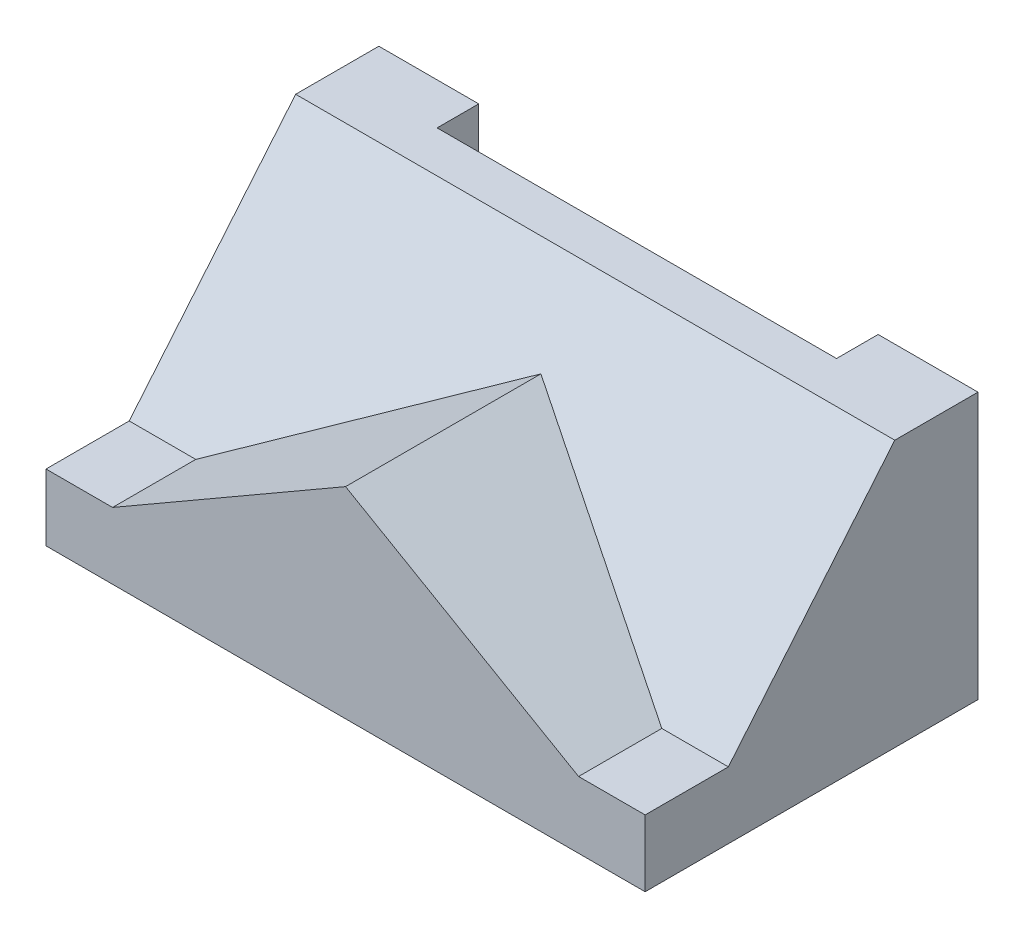
ISO-10303-21;
HEADER;
FILE_DESCRIPTION(('STEP AP214'),'2;1');
FILE_NAME('part.step','',(''),(''),'','','');
FILE_SCHEMA(('AUTOMOTIVE_DESIGN { 1 0 10303 214 1 1 1 1 }'));
ENDSEC;
DATA;
#1=APPLICATION_CONTEXT('core data for automotive mechanical design processes');
#2=APPLICATION_PROTOCOL_DEFINITION('international standard','automotive_design',2000,#1);
#3=PRODUCT_CONTEXT('',#1,'mechanical');
#4=PRODUCT('Part','Part','',(#3));
#5=PRODUCT_RELATED_PRODUCT_CATEGORY('part','',(#4));
#6=PRODUCT_DEFINITION_FORMATION('','',#4);
#7=PRODUCT_DEFINITION_CONTEXT('part definition',#1,'design');
#8=PRODUCT_DEFINITION('design','',#6,#7);
#9=PRODUCT_DEFINITION_SHAPE('','',#8);
#10=(LENGTH_UNIT() NAMED_UNIT(*) SI_UNIT(.MILLI.,.METRE.));
#11=(NAMED_UNIT(*) PLANE_ANGLE_UNIT() SI_UNIT($,.RADIAN.));
#12=(NAMED_UNIT(*) SI_UNIT($,.STERADIAN.) SOLID_ANGLE_UNIT());
#13=UNCERTAINTY_MEASURE_WITH_UNIT(LENGTH_MEASURE(1.E-05),#10,'distance_accuracy_value','');
#14=(GEOMETRIC_REPRESENTATION_CONTEXT(3) GLOBAL_UNCERTAINTY_ASSIGNED_CONTEXT((#13)) GLOBAL_UNIT_ASSIGNED_CONTEXT((#10,
#11,#12)) REPRESENTATION_CONTEXT('',''));
#15=CARTESIAN_POINT('',(0.,0.,0.));
#16=DIRECTION('',(0.,0.,1.));
#17=DIRECTION('',(1.,0.,0.));
#18=AXIS2_PLACEMENT_3D('',#15,#16,#17);
#19=CARTESIAN_POINT('',(57.15,0.,0.));
#20=DIRECTION('',(0.,0.,1.));
#21=DIRECTION('',(1.,0.,0.));
#22=AXIS2_PLACEMENT_3D('',#19,#20,#21);
#23=PLANE('',#22);
#24=DIRECTION('',(-1.,0.,0.));
#25=VECTOR('',#24,1.);
#26=CARTESIAN_POINT('',(57.15,50.8,0.));
#27=LINE('',#26,#25);
#28=CARTESIAN_POINT('',(-38.1,50.8,0.));
#29=VERTEX_POINT('',#28);
#30=CARTESIAN_POINT('',(-57.15,50.8,0.));
#31=VERTEX_POINT('',#30);
#32=EDGE_CURVE('E217',#29,#31,#27,.T.);
#33=ORIENTED_EDGE('',*,*,#32,.F.);
#34=DIRECTION('',(0.,1.,0.));
#35=VECTOR('',#34,1.);
#36=CARTESIAN_POINT('',(-38.1,-0.001000000000001,0.));
#37=LINE('',#36,#35);
#38=CARTESIAN_POINT('',(-38.1,0.,0.));
#39=VERTEX_POINT('',#38);
#40=EDGE_CURVE('E145',#39,#29,#37,.T.);
#41=ORIENTED_EDGE('',*,*,#40,.F.);
#42=DIRECTION('',(-1.,0.,0.));
#43=VECTOR('',#42,1.);
#44=CARTESIAN_POINT('',(57.15,0.,0.));
#45=LINE('',#44,#43);
#46=CARTESIAN_POINT('',(-57.15,0.,0.));
#47=VERTEX_POINT('',#46);
#48=EDGE_CURVE('E150',#39,#47,#45,.T.);
#49=ORIENTED_EDGE('',*,*,#48,.T.);
#50=DIRECTION('',(0.,1.,0.));
#51=VECTOR('',#50,1.);
#52=CARTESIAN_POINT('',(-57.15,0.,0.));
#53=LINE('',#52,#51);
#54=EDGE_CURVE('E197',#47,#31,#53,.T.);
#55=ORIENTED_EDGE('',*,*,#54,.T.);
#56=EDGE_LOOP('',(#33,#41,#49,#55));
#57=FACE_BOUND('',#56,.T.);
#58=ADVANCED_FACE('F33',(#57),#23,.F.);
#59=CARTESIAN_POINT('',(57.15,12.7,47.625));
#60=DIRECTION('',(0.,-1.,0.));
#61=DIRECTION('',(0.,0.,-1.));
#62=AXIS2_PLACEMENT_3D('',#59,#60,#61);
#63=PLANE('',#62);
#64=DIRECTION('',(-1.,0.,0.));
#65=VECTOR('',#64,1.);
#66=CARTESIAN_POINT('',(57.15,12.7,47.625));
#67=LINE('',#66,#65);
#68=CARTESIAN_POINT('',(57.15,12.7,47.625));
#69=VERTEX_POINT('',#68);
#70=CARTESIAN_POINT('',(44.45,12.7,47.6249999999823));
#71=VERTEX_POINT('',#70);
#72=EDGE_CURVE('E211',#69,#71,#67,.T.);
#73=ORIENTED_EDGE('',*,*,#72,.T.);
#74=DIRECTION('',(0.,0.,1.));
#75=VECTOR('',#74,1.);
#76=CARTESIAN_POINT('',(44.45,12.7,-500000.));
#77=LINE('',#76,#75);
#78=CARTESIAN_POINT('',(44.45,12.7,63.5));
#79=VERTEX_POINT('',#78);
#80=EDGE_CURVE('E174',#71,#79,#77,.T.);
#81=ORIENTED_EDGE('',*,*,#80,.T.);
#82=DIRECTION('',(-1.,0.,0.));
#83=VECTOR('',#82,1.);
#84=CARTESIAN_POINT('',(57.15,12.7,63.5));
#85=LINE('',#84,#83);
#86=CARTESIAN_POINT('',(57.15,12.7,63.5));
#87=VERTEX_POINT('',#86);
#88=EDGE_CURVE('E207',#87,#79,#85,.T.);
#89=ORIENTED_EDGE('',*,*,#88,.F.);
#90=DIRECTION('',(0.,0.,1.));
#91=VECTOR('',#90,1.);
#92=CARTESIAN_POINT('',(57.15,12.7,47.625));
#93=LINE('',#92,#91);
#94=EDGE_CURVE('E190',#69,#87,#93,.T.);
#95=ORIENTED_EDGE('',*,*,#94,.F.);
#96=EDGE_LOOP('',(#73,#81,#89,#95));
#97=FACE_BOUND('',#96,.T.);
#98=ADVANCED_FACE('F265',(#97),#63,.F.);
#99=CARTESIAN_POINT('',(57.15,12.7,63.5));
#100=DIRECTION('',(0.,0.,-1.));
#101=DIRECTION('',(-1.,0.,0.));
#102=AXIS2_PLACEMENT_3D('',#99,#100,#101);
#103=PLANE('',#102);
#104=DIRECTION('',(0.,-1.,0.));
#105=VECTOR('',#104,1.);
#106=CARTESIAN_POINT('',(-57.15,12.7,63.5));
#107=LINE('',#106,#105);
#108=CARTESIAN_POINT('',(-57.15,12.7,63.5));
#109=VERTEX_POINT('',#108);
#110=CARTESIAN_POINT('',(-57.15,0.,63.5));
#111=VERTEX_POINT('',#110);
#112=EDGE_CURVE('E169',#109,#111,#107,.T.);
#113=ORIENTED_EDGE('',*,*,#112,.T.);
#114=DIRECTION('',(-1.,0.,0.));
#115=VECTOR('',#114,1.);
#116=CARTESIAN_POINT('',(57.15,0.,63.5));
#117=LINE('',#116,#115);
#118=CARTESIAN_POINT('',(57.15,0.,63.5));
#119=VERTEX_POINT('',#118);
#120=EDGE_CURVE('E11',#119,#111,#117,.T.);
#121=ORIENTED_EDGE('',*,*,#120,.F.);
#122=DIRECTION('',(0.,-1.,0.));
#123=VECTOR('',#122,1.);
#124=CARTESIAN_POINT('',(57.15,12.7,63.5));
#125=LINE('',#124,#123);
#126=EDGE_CURVE('E178',#87,#119,#125,.T.);
#127=ORIENTED_EDGE('',*,*,#126,.F.);
#128=ORIENTED_EDGE('',*,*,#88,.T.);
#129=DIRECTION('',(-0.86602540378444,0.499999999999998,0.));
#130=VECTOR('',#129,1.);
#131=CARTESIAN_POINT('',(44.45,12.7,63.5));
#132=LINE('',#131,#130);
#133=CARTESIAN_POINT('',(0.,38.3632194654787,63.5));
#134=VERTEX_POINT('',#133);
#135=EDGE_CURVE('E170',#79,#134,#132,.T.);
#136=ORIENTED_EDGE('',*,*,#135,.T.);
#137=DIRECTION('',(-0.86602540378444,-0.499999999999998,0.));
#138=VECTOR('',#137,1.);
#139=CARTESIAN_POINT('',(-44.45,12.7,63.5));
#140=LINE('',#139,#138);
#141=CARTESIAN_POINT('',(-44.45,12.7,63.5));
#142=VERTEX_POINT('',#141);
#143=EDGE_CURVE('E56',#134,#142,#140,.T.);
#144=ORIENTED_EDGE('',*,*,#143,.T.);
#145=EDGE_CURVE('E192',#142,#109,#85,.T.);
#146=ORIENTED_EDGE('',*,*,#145,.T.);
#147=EDGE_LOOP('',(#113,#121,#127,#128,#136,#144,#146));
#148=FACE_BOUND('',#147,.T.);
#149=ADVANCED_FACE('F35',(#148),#103,.F.);
#150=CARTESIAN_POINT('',(57.15,0.,63.5));
#151=DIRECTION('',(0.,1.,0.));
#152=DIRECTION('',(0.,0.,1.));
#153=AXIS2_PLACEMENT_3D('',#150,#151,#152);
#154=PLANE('',#153);
#155=ORIENTED_EDGE('',*,*,#48,.F.);
#156=DIRECTION('',(0.,0.,-1.));
#157=VECTOR('',#156,1.);
#158=CARTESIAN_POINT('',(-38.1,0.,0.));
#159=LINE('',#158,#157);
#160=CARTESIAN_POINT('',(-38.1,0.,7.93750000000003));
#161=VERTEX_POINT('',#160);
#162=EDGE_CURVE('E130',#161,#39,#159,.T.);
#163=ORIENTED_EDGE('',*,*,#162,.F.);
#164=DIRECTION('',(-1.,0.,0.));
#165=VECTOR('',#164,1.);
#166=CARTESIAN_POINT('',(-38.1,0.,7.93750000000003));
#167=LINE('',#166,#165);
#168=CARTESIAN_POINT('',(38.1,0.,7.93750000000002));
#169=VERTEX_POINT('',#168);
#170=EDGE_CURVE('E139',#169,#161,#167,.T.);
#171=ORIENTED_EDGE('',*,*,#170,.F.);
#172=DIRECTION('',(0.,0.,1.));
#173=VECTOR('',#172,1.);
#174=CARTESIAN_POINT('',(38.1,0.,0.));
#175=LINE('',#174,#173);
#176=CARTESIAN_POINT('',(38.1,0.,0.));
#177=VERTEX_POINT('',#176);
#178=EDGE_CURVE('E151',#177,#169,#175,.T.);
#179=ORIENTED_EDGE('',*,*,#178,.F.);
#180=CARTESIAN_POINT('',(57.15,0.,0.));
#181=VERTEX_POINT('',#180);
#182=EDGE_CURVE('E41',#181,#177,#45,.T.);
#183=ORIENTED_EDGE('',*,*,#182,.F.);
#184=DIRECTION('',(0.,0.,-1.));
#185=VECTOR('',#184,1.);
#186=CARTESIAN_POINT('',(57.15,0.,63.5));
#187=LINE('',#186,#185);
#188=EDGE_CURVE('E181',#119,#181,#187,.T.);
#189=ORIENTED_EDGE('',*,*,#188,.F.);
#190=ORIENTED_EDGE('',*,*,#120,.T.);
#191=DIRECTION('',(0.,0.,-1.));
#192=VECTOR('',#191,1.);
#193=CARTESIAN_POINT('',(-57.15,0.,63.5));
#194=LINE('',#193,#192);
#195=EDGE_CURVE('E195',#111,#47,#194,.T.);
#196=ORIENTED_EDGE('',*,*,#195,.T.);
#197=EDGE_LOOP('',(#155,#163,#171,#179,#183,#189,#190,#196));
#198=FACE_BOUND('',#197,.T.);
#199=ADVANCED_FACE('F148',(#198),#154,.F.);
#200=ORIENTED_EDGE('',*,*,#182,.T.);
#201=DIRECTION('',(0.,1.,0.));
#202=VECTOR('',#201,1.);
#203=CARTESIAN_POINT('',(38.1,-0.001000000000001,0.));
#204=LINE('',#203,#202);
#205=CARTESIAN_POINT('',(38.1,50.8,0.));
#206=VERTEX_POINT('',#205);
#207=EDGE_CURVE('E160',#177,#206,#204,.T.);
#208=ORIENTED_EDGE('',*,*,#207,.T.);
#209=CARTESIAN_POINT('',(57.15,50.8,0.));
#210=VERTEX_POINT('',#209);
#211=EDGE_CURVE('E218',#210,#206,#27,.T.);
#212=ORIENTED_EDGE('',*,*,#211,.F.);
#213=DIRECTION('',(0.,1.,0.));
#214=VECTOR('',#213,1.);
#215=CARTESIAN_POINT('',(57.15,0.,0.));
#216=LINE('',#215,#214);
#217=EDGE_CURVE('E184',#181,#210,#216,.T.);
#218=ORIENTED_EDGE('',*,*,#217,.F.);
#219=EDGE_LOOP('',(#200,#208,#212,#218));
#220=FACE_BOUND('',#219,.T.);
#221=ADVANCED_FACE('F251',(#220),#23,.F.);
#222=CARTESIAN_POINT('',(57.15,50.8,0.));
#223=DIRECTION('',(0.,-1.,0.));
#224=DIRECTION('',(0.,0.,-1.));
#225=AXIS2_PLACEMENT_3D('',#222,#223,#224);
#226=PLANE('',#225);
#227=DIRECTION('',(1.,0.,0.));
#228=VECTOR('',#227,1.);
#229=CARTESIAN_POINT('',(-38.1,50.8,7.93750000000004));
#230=LINE('',#229,#228);
#231=CARTESIAN_POINT('',(-38.1,50.8,7.93750000000005));
#232=VERTEX_POINT('',#231);
#233=CARTESIAN_POINT('',(38.1,50.8,7.93750000000003));
#234=VERTEX_POINT('',#233);
#235=EDGE_CURVE('E153',#232,#234,#230,.T.);
#236=ORIENTED_EDGE('',*,*,#235,.F.);
#237=DIRECTION('',(0.,0.,1.));
#238=VECTOR('',#237,1.);
#239=CARTESIAN_POINT('',(-38.1,50.8,0.));
#240=LINE('',#239,#238);
#241=EDGE_CURVE('E48',#29,#232,#240,.T.);
#242=ORIENTED_EDGE('',*,*,#241,.F.);
#243=ORIENTED_EDGE('',*,*,#32,.T.);
#244=DIRECTION('',(0.,0.,1.));
#245=VECTOR('',#244,1.);
#246=CARTESIAN_POINT('',(-57.15,50.8,0.));
#247=LINE('',#246,#245);
#248=CARTESIAN_POINT('',(-57.15,50.8,15.875));
#249=VERTEX_POINT('',#248);
#250=EDGE_CURVE('E200',#31,#249,#247,.T.);
#251=ORIENTED_EDGE('',*,*,#250,.T.);
#252=DIRECTION('',(-1.,0.,0.));
#253=VECTOR('',#252,1.);
#254=CARTESIAN_POINT('',(57.15,50.8,15.875));
#255=LINE('',#254,#253);
#256=CARTESIAN_POINT('',(57.15,50.8,15.875));
#257=VERTEX_POINT('',#256);
#258=EDGE_CURVE('E214',#257,#249,#255,.T.);
#259=ORIENTED_EDGE('',*,*,#258,.F.);
#260=DIRECTION('',(0.,0.,1.));
#261=VECTOR('',#260,1.);
#262=CARTESIAN_POINT('',(57.15,50.8,0.));
#263=LINE('',#262,#261);
#264=EDGE_CURVE('E186',#210,#257,#263,.T.);
#265=ORIENTED_EDGE('',*,*,#264,.F.);
#266=ORIENTED_EDGE('',*,*,#211,.T.);
#267=DIRECTION('',(0.,0.,-1.));
#268=VECTOR('',#267,1.);
#269=CARTESIAN_POINT('',(38.1,50.8,0.));
#270=LINE('',#269,#268);
#271=EDGE_CURVE('E136',#234,#206,#270,.T.);
#272=ORIENTED_EDGE('',*,*,#271,.F.);
#273=EDGE_LOOP('',(#236,#242,#243,#251,#259,#265,#266,#272));
#274=FACE_BOUND('',#273,.T.);
#275=ADVANCED_FACE('F236',(#274),#226,.F.);
#276=CARTESIAN_POINT('',(57.15,50.8,15.875));
#277=DIRECTION('',(0.,-0.64018439966448,-0.768221279597376));
#278=DIRECTION('',(0.,0.768221279597376,-0.64018439966448));
#279=AXIS2_PLACEMENT_3D('',#276,#277,#278);
#280=PLANE('',#279);
#281=DIRECTION('',(-0.799408065031791,-0.46153846153846,0.384615384615383));
#282=VECTOR('',#281,1.);
#283=CARTESIAN_POINT('',(153702.51320192,88778.5505917153,-73923.9171597629));
#284=LINE('',#283,#282);
#285=CARTESIAN_POINT('',(0.,38.3632194654727,26.2389837787183));
#286=VERTEX_POINT('',#285);
#287=CARTESIAN_POINT('',(-44.45,12.7,47.6249999999823));
#288=VERTEX_POINT('',#287);
#289=EDGE_CURVE('E144',#286,#288,#284,.T.);
#290=ORIENTED_EDGE('',*,*,#289,.F.);
#291=DIRECTION('',(-0.799408065031791,0.46153846153846,-0.384615384615383));
#292=VECTOR('',#291,1.);
#293=CARTESIAN_POINT('',(-153702.51320192,88778.5505917153,-73923.9171597629));
#294=LINE('',#293,#292);
#295=EDGE_CURVE('E165',#71,#286,#294,.T.);
#296=ORIENTED_EDGE('',*,*,#295,.F.);
#297=ORIENTED_EDGE('',*,*,#72,.F.);
#298=DIRECTION('',(0.,-0.768221279597376,0.64018439966448));
#299=VECTOR('',#298,1.);
#300=CARTESIAN_POINT('',(57.15,50.8,15.875));
#301=LINE('',#300,#299);
#302=EDGE_CURVE('E188',#257,#69,#301,.T.);
#303=ORIENTED_EDGE('',*,*,#302,.F.);
#304=ORIENTED_EDGE('',*,*,#258,.T.);
#305=DIRECTION('',(0.,-0.768221279597376,0.64018439966448));
#306=VECTOR('',#305,1.);
#307=CARTESIAN_POINT('',(-57.15,50.8,15.875));
#308=LINE('',#307,#306);
#309=CARTESIAN_POINT('',(-57.15,12.7,47.625));
#310=VERTEX_POINT('',#309);
#311=EDGE_CURVE('E202',#249,#310,#308,.T.);
#312=ORIENTED_EDGE('',*,*,#311,.T.);
#313=EDGE_CURVE('E210',#288,#310,#67,.T.);
#314=ORIENTED_EDGE('',*,*,#313,.F.);
#315=EDGE_LOOP('',(#290,#296,#297,#303,#304,#312,#314));
#316=FACE_BOUND('',#315,.T.);
#317=ADVANCED_FACE('F241',(#316),#280,.F.);
#318=ORIENTED_EDGE('',*,*,#145,.F.);
#319=DIRECTION('',(0.,0.,1.));
#320=VECTOR('',#319,1.);
#321=CARTESIAN_POINT('',(-44.45,12.7,-500000.));
#322=LINE('',#321,#320);
#323=EDGE_CURVE('E167',#288,#142,#322,.T.);
#324=ORIENTED_EDGE('',*,*,#323,.F.);
#325=ORIENTED_EDGE('',*,*,#313,.T.);
#326=DIRECTION('',(0.,0.,1.));
#327=VECTOR('',#326,1.);
#328=CARTESIAN_POINT('',(-57.15,12.7,47.625));
#329=LINE('',#328,#327);
#330=EDGE_CURVE('E182',#310,#109,#329,.T.);
#331=ORIENTED_EDGE('',*,*,#330,.T.);
#332=EDGE_LOOP('',(#318,#324,#325,#331));
#333=FACE_BOUND('',#332,.T.);
#334=ADVANCED_FACE('F257',(#333),#63,.F.);
#335=CARTESIAN_POINT('',(57.15,0.,0.));
#336=DIRECTION('',(1.,0.,0.));
#337=DIRECTION('',(0.,0.,-1.));
#338=AXIS2_PLACEMENT_3D('',#335,#336,#337);
#339=PLANE('',#338);
#340=ORIENTED_EDGE('',*,*,#126,.T.);
#341=ORIENTED_EDGE('',*,*,#188,.T.);
#342=ORIENTED_EDGE('',*,*,#217,.T.);
#343=ORIENTED_EDGE('',*,*,#264,.T.);
#344=ORIENTED_EDGE('',*,*,#302,.T.);
#345=ORIENTED_EDGE('',*,*,#94,.T.);
#346=EDGE_LOOP('',(#340,#341,#342,#343,#344,#345));
#347=FACE_BOUND('',#346,.T.);
#348=ADVANCED_FACE('F247',(#347),#339,.T.);
#349=CARTESIAN_POINT('',(-57.15,0.,0.));
#350=DIRECTION('',(1.,0.,0.));
#351=DIRECTION('',(0.,0.,-1.));
#352=AXIS2_PLACEMENT_3D('',#349,#350,#351);
#353=PLANE('',#352);
#354=ORIENTED_EDGE('',*,*,#112,.F.);
#355=ORIENTED_EDGE('',*,*,#330,.F.);
#356=ORIENTED_EDGE('',*,*,#311,.F.);
#357=ORIENTED_EDGE('',*,*,#250,.F.);
#358=ORIENTED_EDGE('',*,*,#54,.F.);
#359=ORIENTED_EDGE('',*,*,#195,.F.);
#360=EDGE_LOOP('',(#354,#355,#356,#357,#358,#359));
#361=FACE_BOUND('',#360,.T.);
#362=ADVANCED_FACE('F231',(#361),#353,.F.);
#363=CARTESIAN_POINT('',(44.45,12.7,-500000.));
#364=DIRECTION('',(0.499999999999998,0.86602540378444,0.));
#365=DIRECTION('',(-0.86602540378444,0.499999999999998,0.));
#366=AXIS2_PLACEMENT_3D('',#363,#364,#365);
#367=PLANE('',#366);
#368=ORIENTED_EDGE('',*,*,#80,.F.);
#369=ORIENTED_EDGE('',*,*,#295,.T.);
#370=DIRECTION('',(0.,0.,1.));
#371=VECTOR('',#370,1.);
#372=CARTESIAN_POINT('',(0.,38.3632194654787,-500000.));
#373=LINE('',#372,#371);
#374=EDGE_CURVE('E172',#286,#134,#373,.T.);
#375=ORIENTED_EDGE('',*,*,#374,.T.);
#376=ORIENTED_EDGE('',*,*,#135,.F.);
#377=EDGE_LOOP('',(#368,#369,#375,#376));
#378=FACE_BOUND('',#377,.T.);
#379=ADVANCED_FACE('F263',(#378),#367,.T.);
#380=CARTESIAN_POINT('',(-44.45,12.7,-500000.));
#381=DIRECTION('',(-0.499999999999998,0.86602540378444,0.));
#382=DIRECTION('',(-0.86602540378444,-0.499999999999998,0.));
#383=AXIS2_PLACEMENT_3D('',#380,#381,#382);
#384=PLANE('',#383);
#385=ORIENTED_EDGE('',*,*,#374,.F.);
#386=ORIENTED_EDGE('',*,*,#289,.T.);
#387=ORIENTED_EDGE('',*,*,#323,.T.);
#388=ORIENTED_EDGE('',*,*,#143,.F.);
#389=EDGE_LOOP('',(#385,#386,#387,#388));
#390=FACE_BOUND('',#389,.T.);
#391=ADVANCED_FACE('F261',(#390),#384,.T.);
#392=CARTESIAN_POINT('',(-38.1,-0.001000000000001,0.));
#393=DIRECTION('',(-1.,0.,0.));
#394=DIRECTION('',(0.,0.,1.));
#395=AXIS2_PLACEMENT_3D('',#392,#393,#394);
#396=PLANE('',#395);
#397=ORIENTED_EDGE('',*,*,#162,.T.);
#398=ORIENTED_EDGE('',*,*,#40,.T.);
#399=ORIENTED_EDGE('',*,*,#241,.T.);
#400=DIRECTION('',(0.,1.,0.));
#401=VECTOR('',#400,1.);
#402=CARTESIAN_POINT('',(-38.1,-0.001000000000001,7.93750000000003));
#403=LINE('',#402,#401);
#404=EDGE_CURVE('E126',#161,#232,#403,.T.);
#405=ORIENTED_EDGE('',*,*,#404,.F.);
#406=EDGE_LOOP('',(#397,#398,#399,#405));
#407=FACE_BOUND('',#406,.T.);
#408=ADVANCED_FACE('F128',(#407),#396,.F.);
#409=CARTESIAN_POINT('',(38.1,-0.001000000000001,0.));
#410=DIRECTION('',(1.,0.,0.));
#411=DIRECTION('',(0.,0.,-1.));
#412=AXIS2_PLACEMENT_3D('',#409,#410,#411);
#413=PLANE('',#412);
#414=ORIENTED_EDGE('',*,*,#178,.T.);
#415=DIRECTION('',(0.,1.,0.));
#416=VECTOR('',#415,1.);
#417=CARTESIAN_POINT('',(38.1,-0.001000000000001,7.93750000000002));
#418=LINE('',#417,#416);
#419=EDGE_CURVE('E135',#169,#234,#418,.T.);
#420=ORIENTED_EDGE('',*,*,#419,.T.);
#421=ORIENTED_EDGE('',*,*,#271,.T.);
#422=ORIENTED_EDGE('',*,*,#207,.F.);
#423=EDGE_LOOP('',(#414,#420,#421,#422));
#424=FACE_BOUND('',#423,.T.);
#425=ADVANCED_FACE('F253',(#424),#413,.F.);
#426=CARTESIAN_POINT('',(-38.1,-0.001000000000001,7.93750000000003));
#427=DIRECTION('',(0.,0.,1.));
#428=DIRECTION('',(0.,-1.,0.));
#429=AXIS2_PLACEMENT_3D('',#426,#427,#428);
#430=PLANE('',#429);
#431=ORIENTED_EDGE('',*,*,#170,.T.);
#432=ORIENTED_EDGE('',*,*,#404,.T.);
#433=ORIENTED_EDGE('',*,*,#235,.T.);
#434=ORIENTED_EDGE('',*,*,#419,.F.);
#435=EDGE_LOOP('',(#431,#432,#433,#434));
#436=FACE_BOUND('',#435,.T.);
#437=ADVANCED_FACE('F140',(#436),#430,.F.);
#438=CLOSED_SHELL('',(#58,#98,#149,#199,#221,#275,#317,#334,#348,#362,#379,#391,#408,#425,#437));
#439=MANIFOLD_SOLID_BREP('B2',#438);
#440=ADVANCED_BREP_SHAPE_REPRESENTATION('',(#18,#439),#14);
#441=SHAPE_DEFINITION_REPRESENTATION(#9,#440);
ENDSEC;
END-ISO-10303-21;
